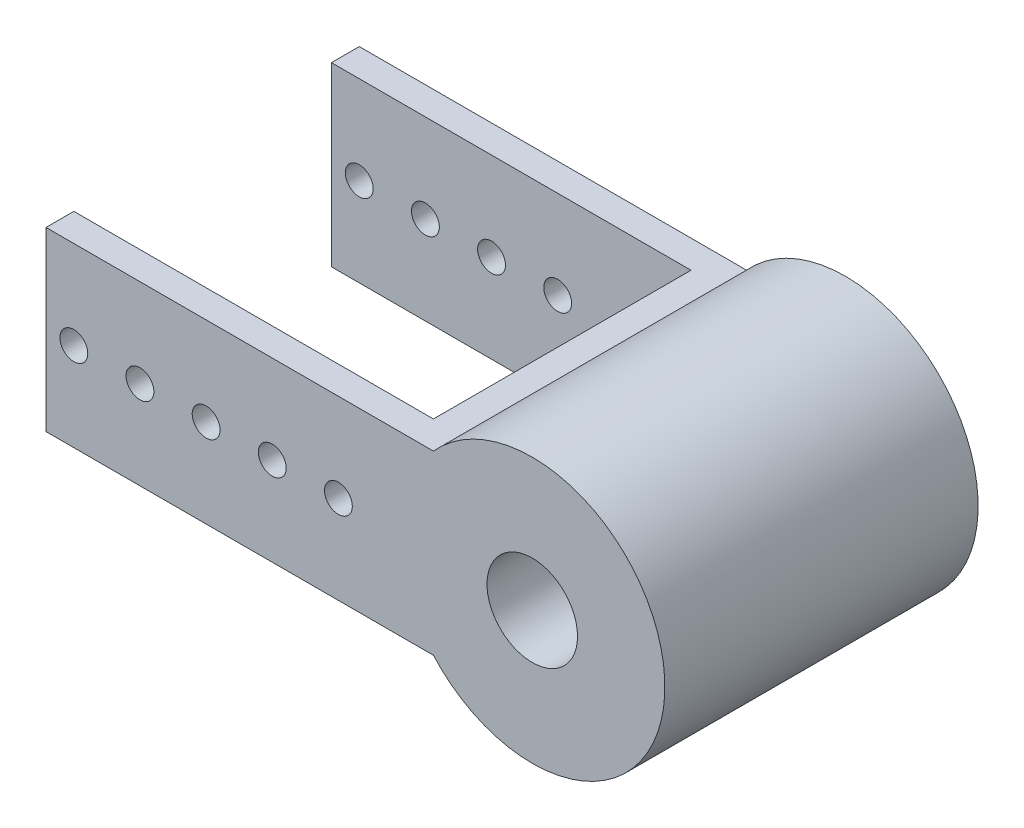
ISO-10303-21;
HEADER;
FILE_DESCRIPTION(('STEP AP214'),'2;1');
FILE_NAME('part.step','',(''),(''),'','','');
FILE_SCHEMA(('AUTOMOTIVE_DESIGN { 1 0 10303 214 1 1 1 1 }'));
ENDSEC;
DATA;
#1=APPLICATION_CONTEXT('core data for automotive mechanical design processes');
#2=APPLICATION_PROTOCOL_DEFINITION('international standard','automotive_design',2000,#1);
#3=PRODUCT_CONTEXT('',#1,'mechanical');
#4=PRODUCT('Part','Part','',(#3));
#5=PRODUCT_RELATED_PRODUCT_CATEGORY('part','',(#4));
#6=PRODUCT_DEFINITION_FORMATION('','',#4);
#7=PRODUCT_DEFINITION_CONTEXT('part definition',#1,'design');
#8=PRODUCT_DEFINITION('design','',#6,#7);
#9=PRODUCT_DEFINITION_SHAPE('','',#8);
#10=(LENGTH_UNIT() NAMED_UNIT(*) SI_UNIT(.MILLI.,.METRE.));
#11=(NAMED_UNIT(*) PLANE_ANGLE_UNIT() SI_UNIT($,.RADIAN.));
#12=(NAMED_UNIT(*) SI_UNIT($,.STERADIAN.) SOLID_ANGLE_UNIT());
#13=UNCERTAINTY_MEASURE_WITH_UNIT(LENGTH_MEASURE(1.E-05),#10,'distance_accuracy_value','');
#14=(GEOMETRIC_REPRESENTATION_CONTEXT(3) GLOBAL_UNCERTAINTY_ASSIGNED_CONTEXT((#13)) GLOBAL_UNIT_ASSIGNED_CONTEXT((#10,
#11,#12)) REPRESENTATION_CONTEXT('',''));
#15=CARTESIAN_POINT('',(0.,0.,0.));
#16=DIRECTION('',(0.,0.,1.));
#17=DIRECTION('',(1.,0.,0.));
#18=AXIS2_PLACEMENT_3D('',#15,#16,#17);
#19=CARTESIAN_POINT('',(-139.7,25.4,45.));
#20=DIRECTION('',(1.,0.,0.));
#21=DIRECTION('',(0.,0.,-1.));
#22=AXIS2_PLACEMENT_3D('',#19,#20,#21);
#23=PLANE('',#22);
#24=DIRECTION('',(0.,0.,-1.));
#25=VECTOR('',#24,1.);
#26=CARTESIAN_POINT('',(-139.7,-25.4,45.));
#27=LINE('',#26,#25);
#28=CARTESIAN_POINT('',(-139.7,-25.4,-37.));
#29=VERTEX_POINT('',#28);
#30=CARTESIAN_POINT('',(-139.7,-25.4,-45.));
#31=VERTEX_POINT('',#30);
#32=EDGE_CURVE('E189',#29,#31,#27,.T.);
#33=ORIENTED_EDGE('',*,*,#32,.F.);
#34=DIRECTION('',(0.,1.,0.));
#35=VECTOR('',#34,1.);
#36=CARTESIAN_POINT('',(-139.7,-38.1,-37.));
#37=LINE('',#36,#35);
#38=CARTESIAN_POINT('',(-139.7,25.4,-37.));
#39=VERTEX_POINT('',#38);
#40=EDGE_CURVE('E200',#29,#39,#37,.T.);
#41=ORIENTED_EDGE('',*,*,#40,.T.);
#42=DIRECTION('',(0.,0.,-1.));
#43=VECTOR('',#42,1.);
#44=CARTESIAN_POINT('',(-139.7,25.4,45.));
#45=LINE('',#44,#43);
#46=CARTESIAN_POINT('',(-139.7,25.4,-45.));
#47=VERTEX_POINT('',#46);
#48=EDGE_CURVE('E193',#39,#47,#45,.T.);
#49=ORIENTED_EDGE('',*,*,#48,.T.);
#50=DIRECTION('',(0.,-1.,0.));
#51=VECTOR('',#50,1.);
#52=CARTESIAN_POINT('',(-139.7,25.4,-45.));
#53=LINE('',#52,#51);
#54=EDGE_CURVE('E184',#47,#31,#53,.T.);
#55=ORIENTED_EDGE('',*,*,#54,.T.);
#56=EDGE_LOOP('',(#33,#41,#49,#55));
#57=FACE_BOUND('',#56,.T.);
#58=ADVANCED_FACE('F37',(#57),#23,.F.);
#59=CARTESIAN_POINT('',(-131.7,0.,45.));
#60=DIRECTION('',(0.,0.,-1.));
#61=DIRECTION('',(-1.,0.,0.));
#62=AXIS2_PLACEMENT_3D('',#59,#60,#61);
#63=CYLINDRICAL_SURFACE('',#62,3.99999999999999);
#64=CARTESIAN_POINT('',(-131.7,0.,-37.));
#65=DIRECTION('',(0.,0.,-1.));
#66=DIRECTION('',(-1.,0.,0.));
#67=AXIS2_PLACEMENT_3D('',#64,#65,#66);
#68=CIRCLE('',#67,3.99999999999999);
#69=CARTESIAN_POINT('',(-135.7,0.,-37.));
#70=VERTEX_POINT('',#69);
#71=EDGE_CURVE('E217',#70,#70,#68,.T.);
#72=ORIENTED_EDGE('',*,*,#71,.F.);
#73=EDGE_LOOP('',(#72));
#74=FACE_BOUND('',#73,.T.);
#75=CARTESIAN_POINT('',(-131.7,0.,-45.));
#76=DIRECTION('',(0.,0.,1.));
#77=DIRECTION('',(1.,0.,0.));
#78=AXIS2_PLACEMENT_3D('',#75,#76,#77);
#79=CIRCLE('',#78,3.99999999999999);
#80=CARTESIAN_POINT('',(-127.7,0.,-45.));
#81=VERTEX_POINT('',#80);
#82=EDGE_CURVE('E157',#81,#81,#79,.T.);
#83=ORIENTED_EDGE('',*,*,#82,.F.);
#84=EDGE_LOOP('',(#83));
#85=FACE_BOUND('',#84,.T.);
#86=ADVANCED_FACE('F260',(#74,#85),#63,.F.);
#87=CARTESIAN_POINT('',(-112.7,0.,45.));
#88=DIRECTION('',(0.,0.,-1.));
#89=DIRECTION('',(-1.,0.,0.));
#90=AXIS2_PLACEMENT_3D('',#87,#88,#89);
#91=CYLINDRICAL_SURFACE('',#90,3.99999999999999);
#92=CARTESIAN_POINT('',(-112.7,0.,-37.));
#93=DIRECTION('',(0.,0.,-1.));
#94=DIRECTION('',(-1.,0.,0.));
#95=AXIS2_PLACEMENT_3D('',#92,#93,#94);
#96=CIRCLE('',#95,3.99999999999999);
#97=CARTESIAN_POINT('',(-116.7,0.,-37.));
#98=VERTEX_POINT('',#97);
#99=EDGE_CURVE('E211',#98,#98,#96,.T.);
#100=ORIENTED_EDGE('',*,*,#99,.F.);
#101=EDGE_LOOP('',(#100));
#102=FACE_BOUND('',#101,.T.);
#103=CARTESIAN_POINT('',(-112.7,0.,-45.));
#104=DIRECTION('',(0.,0.,1.));
#105=DIRECTION('',(1.,0.,0.));
#106=AXIS2_PLACEMENT_3D('',#103,#104,#105);
#107=CIRCLE('',#106,3.99999999999999);
#108=CARTESIAN_POINT('',(-108.7,0.,-45.));
#109=VERTEX_POINT('',#108);
#110=EDGE_CURVE('E151',#109,#109,#107,.T.);
#111=ORIENTED_EDGE('',*,*,#110,.F.);
#112=EDGE_LOOP('',(#111));
#113=FACE_BOUND('',#112,.T.);
#114=ADVANCED_FACE('F297',(#102,#113),#91,.F.);
#115=CARTESIAN_POINT('',(-93.7,0.,45.));
#116=DIRECTION('',(0.,0.,-1.));
#117=DIRECTION('',(-1.,0.,0.));
#118=AXIS2_PLACEMENT_3D('',#115,#116,#117);
#119=CYLINDRICAL_SURFACE('',#118,3.99999999999999);
#120=CARTESIAN_POINT('',(-93.7,0.,-37.));
#121=DIRECTION('',(0.,0.,-1.));
#122=DIRECTION('',(-1.,0.,0.));
#123=AXIS2_PLACEMENT_3D('',#120,#121,#122);
#124=CIRCLE('',#123,3.99999999999999);
#125=CARTESIAN_POINT('',(-97.7,0.,-37.));
#126=VERTEX_POINT('',#125);
#127=EDGE_CURVE('E206',#126,#126,#124,.T.);
#128=ORIENTED_EDGE('',*,*,#127,.F.);
#129=EDGE_LOOP('',(#128));
#130=FACE_BOUND('',#129,.T.);
#131=CARTESIAN_POINT('',(-93.7,0.,-45.));
#132=DIRECTION('',(0.,0.,1.));
#133=DIRECTION('',(1.,0.,0.));
#134=AXIS2_PLACEMENT_3D('',#131,#132,#133);
#135=CIRCLE('',#134,3.99999999999999);
#136=CARTESIAN_POINT('',(-89.7,0.,-45.));
#137=VERTEX_POINT('',#136);
#138=EDGE_CURVE('E145',#137,#137,#135,.T.);
#139=ORIENTED_EDGE('',*,*,#138,.F.);
#140=EDGE_LOOP('',(#139));
#141=FACE_BOUND('',#140,.T.);
#142=ADVANCED_FACE('F323',(#130,#141),#119,.F.);
#143=CARTESIAN_POINT('',(-74.7,0.,45.));
#144=DIRECTION('',(0.,0.,-1.));
#145=DIRECTION('',(-1.,0.,0.));
#146=AXIS2_PLACEMENT_3D('',#143,#144,#145);
#147=CYLINDRICAL_SURFACE('',#146,3.99999999999999);
#148=CARTESIAN_POINT('',(-74.7,0.,-37.));
#149=DIRECTION('',(0.,0.,-1.));
#150=DIRECTION('',(-1.,0.,0.));
#151=AXIS2_PLACEMENT_3D('',#148,#149,#150);
#152=CIRCLE('',#151,3.99999999999999);
#153=CARTESIAN_POINT('',(-78.7,0.,-37.));
#154=VERTEX_POINT('',#153);
#155=EDGE_CURVE('E202',#154,#154,#152,.T.);
#156=ORIENTED_EDGE('',*,*,#155,.F.);
#157=EDGE_LOOP('',(#156));
#158=FACE_BOUND('',#157,.T.);
#159=CARTESIAN_POINT('',(-74.7,0.,-45.));
#160=DIRECTION('',(0.,0.,1.));
#161=DIRECTION('',(1.,0.,0.));
#162=AXIS2_PLACEMENT_3D('',#159,#160,#161);
#163=CIRCLE('',#162,3.99999999999999);
#164=CARTESIAN_POINT('',(-70.7,0.,-45.));
#165=VERTEX_POINT('',#164);
#166=EDGE_CURVE('E140',#165,#165,#163,.T.);
#167=ORIENTED_EDGE('',*,*,#166,.F.);
#168=EDGE_LOOP('',(#167));
#169=FACE_BOUND('',#168,.T.);
#170=ADVANCED_FACE('F287',(#158,#169),#147,.F.);
#171=CARTESIAN_POINT('',(-55.7,0.,45.));
#172=DIRECTION('',(0.,0.,-1.));
#173=DIRECTION('',(-1.,0.,0.));
#174=AXIS2_PLACEMENT_3D('',#171,#172,#173);
#175=CYLINDRICAL_SURFACE('',#174,3.99999999999999);
#176=CARTESIAN_POINT('',(-55.7,0.,-37.));
#177=DIRECTION('',(0.,0.,-1.));
#178=DIRECTION('',(-1.,0.,0.));
#179=AXIS2_PLACEMENT_3D('',#176,#177,#178);
#180=CIRCLE('',#179,3.99999999999999);
#181=CARTESIAN_POINT('',(-59.7,0.,-37.));
#182=VERTEX_POINT('',#181);
#183=EDGE_CURVE('E115',#182,#182,#180,.T.);
#184=ORIENTED_EDGE('',*,*,#183,.F.);
#185=EDGE_LOOP('',(#184));
#186=FACE_BOUND('',#185,.T.);
#187=CARTESIAN_POINT('',(-55.7,0.,-45.));
#188=DIRECTION('',(0.,0.,1.));
#189=DIRECTION('',(1.,0.,0.));
#190=AXIS2_PLACEMENT_3D('',#187,#188,#189);
#191=CIRCLE('',#190,3.99999999999999);
#192=CARTESIAN_POINT('',(-51.7,0.,-45.));
#193=VERTEX_POINT('',#192);
#194=EDGE_CURVE('E130',#193,#193,#191,.T.);
#195=ORIENTED_EDGE('',*,*,#194,.F.);
#196=EDGE_LOOP('',(#195));
#197=FACE_BOUND('',#196,.T.);
#198=ADVANCED_FACE('F266',(#186,#197),#175,.F.);
#199=CARTESIAN_POINT('',(0.,0.,45.));
#200=DIRECTION('',(0.,0.,1.));
#201=DIRECTION('',(1.,0.,0.));
#202=AXIS2_PLACEMENT_3D('',#199,#200,#201);
#203=PLANE('',#202);
#204=CARTESIAN_POINT('',(-74.7,0.,45.));
#205=DIRECTION('',(0.,0.,1.));
#206=DIRECTION('',(1.,0.,0.));
#207=AXIS2_PLACEMENT_3D('',#204,#205,#206);
#208=CIRCLE('',#207,3.99999999999999);
#209=CARTESIAN_POINT('',(-70.7,0.,45.));
#210=VERTEX_POINT('',#209);
#211=EDGE_CURVE('E142',#210,#210,#208,.T.);
#212=ORIENTED_EDGE('',*,*,#211,.F.);
#213=EDGE_LOOP('',(#212));
#214=FACE_BOUND('',#213,.T.);
#215=CARTESIAN_POINT('',(-112.7,0.,45.));
#216=DIRECTION('',(0.,0.,1.));
#217=DIRECTION('',(1.,0.,0.));
#218=AXIS2_PLACEMENT_3D('',#215,#216,#217);
#219=CIRCLE('',#218,3.99999999999999);
#220=CARTESIAN_POINT('',(-108.7,0.,45.));
#221=VERTEX_POINT('',#220);
#222=EDGE_CURVE('E154',#221,#221,#219,.T.);
#223=ORIENTED_EDGE('',*,*,#222,.F.);
#224=EDGE_LOOP('',(#223));
#225=FACE_BOUND('',#224,.T.);
#226=CARTESIAN_POINT('',(0.,0.,45.));
#227=DIRECTION('',(0.,0.,1.));
#228=DIRECTION('',(1.,0.,0.));
#229=AXIS2_PLACEMENT_3D('',#226,#227,#228);
#230=CIRCLE('',#229,13.);
#231=CARTESIAN_POINT('',(13.,0.,45.));
#232=VERTEX_POINT('',#231);
#233=EDGE_CURVE('E166',#232,#232,#230,.T.);
#234=ORIENTED_EDGE('',*,*,#233,.F.);
#235=EDGE_LOOP('',(#234));
#236=FACE_BOUND('',#235,.T.);
#237=CARTESIAN_POINT('',(0.,0.,45.));
#238=DIRECTION('',(0.,0.,1.));
#239=DIRECTION('',(1.,0.,0.));
#240=AXIS2_PLACEMENT_3D('',#237,#238,#239);
#241=CIRCLE('',#240,38.1);
#242=CARTESIAN_POINT('',(-28.3980633142473,-25.4,45.));
#243=VERTEX_POINT('',#242);
#244=CARTESIAN_POINT('',(-28.3980633142473,25.4,45.));
#245=VERTEX_POINT('',#244);
#246=EDGE_CURVE('E172',#243,#245,#241,.T.);
#247=ORIENTED_EDGE('',*,*,#246,.T.);
#248=DIRECTION('',(-1.,0.,0.));
#249=VECTOR('',#248,1.);
#250=CARTESIAN_POINT('',(-28.3980633142473,25.4,45.));
#251=LINE('',#250,#249);
#252=CARTESIAN_POINT('',(-139.7,25.4,45.));
#253=VERTEX_POINT('',#252);
#254=EDGE_CURVE('E89',#245,#253,#251,.T.);
#255=ORIENTED_EDGE('',*,*,#254,.T.);
#256=DIRECTION('',(0.,-1.,0.));
#257=VECTOR('',#256,1.);
#258=CARTESIAN_POINT('',(-139.7,25.4,45.));
#259=LINE('',#258,#257);
#260=CARTESIAN_POINT('',(-139.7,-25.4,45.));
#261=VERTEX_POINT('',#260);
#262=EDGE_CURVE('E175',#253,#261,#259,.T.);
#263=ORIENTED_EDGE('',*,*,#262,.T.);
#264=DIRECTION('',(1.,0.,0.));
#265=VECTOR('',#264,1.);
#266=CARTESIAN_POINT('',(-28.3980633142473,-25.4,45.));
#267=LINE('',#266,#265);
#268=EDGE_CURVE('E61',#261,#243,#267,.T.);
#269=ORIENTED_EDGE('',*,*,#268,.T.);
#270=EDGE_LOOP('',(#247,#255,#263,#269));
#271=FACE_BOUND('',#270,.T.);
#272=CARTESIAN_POINT('',(-131.7,0.,45.));
#273=DIRECTION('',(0.,0.,1.));
#274=DIRECTION('',(1.,0.,0.));
#275=AXIS2_PLACEMENT_3D('',#272,#273,#274);
#276=CIRCLE('',#275,3.99999999999999);
#277=CARTESIAN_POINT('',(-127.7,0.,45.));
#278=VERTEX_POINT('',#277);
#279=EDGE_CURVE('E160',#278,#278,#276,.T.);
#280=ORIENTED_EDGE('',*,*,#279,.F.);
#281=EDGE_LOOP('',(#280));
#282=FACE_BOUND('',#281,.T.);
#283=CARTESIAN_POINT('',(-93.7,0.,45.));
#284=DIRECTION('',(0.,0.,1.));
#285=DIRECTION('',(1.,0.,0.));
#286=AXIS2_PLACEMENT_3D('',#283,#284,#285);
#287=CIRCLE('',#286,3.99999999999999);
#288=CARTESIAN_POINT('',(-89.7,0.,45.));
#289=VERTEX_POINT('',#288);
#290=EDGE_CURVE('E148',#289,#289,#287,.T.);
#291=ORIENTED_EDGE('',*,*,#290,.F.);
#292=EDGE_LOOP('',(#291));
#293=FACE_BOUND('',#292,.T.);
#294=CARTESIAN_POINT('',(-55.7,0.,45.));
#295=DIRECTION('',(0.,0.,1.));
#296=DIRECTION('',(1.,0.,0.));
#297=AXIS2_PLACEMENT_3D('',#294,#295,#296);
#298=CIRCLE('',#297,3.99999999999999);
#299=CARTESIAN_POINT('',(-51.7,0.,45.));
#300=VERTEX_POINT('',#299);
#301=EDGE_CURVE('E133',#300,#300,#298,.T.);
#302=ORIENTED_EDGE('',*,*,#301,.F.);
#303=EDGE_LOOP('',(#302));
#304=FACE_BOUND('',#303,.T.);
#305=ADVANCED_FACE('F263',(#214,#225,#236,#271,#282,#293,#304),#203,.T.);
#306=CARTESIAN_POINT('',(0.,0.,-45.));
#307=DIRECTION('',(0.,0.,1.));
#308=DIRECTION('',(1.,0.,0.));
#309=AXIS2_PLACEMENT_3D('',#306,#307,#308);
#310=PLANE('',#309);
#311=CARTESIAN_POINT('',(0.,0.,-45.));
#312=DIRECTION('',(0.,0.,1.));
#313=DIRECTION('',(1.,0.,0.));
#314=AXIS2_PLACEMENT_3D('',#311,#312,#313);
#315=CIRCLE('',#314,38.1);
#316=CARTESIAN_POINT('',(-28.3980633142473,-25.4,-45.));
#317=VERTEX_POINT('',#316);
#318=CARTESIAN_POINT('',(-28.3980633142473,25.4,-45.));
#319=VERTEX_POINT('',#318);
#320=EDGE_CURVE('E169',#317,#319,#315,.T.);
#321=ORIENTED_EDGE('',*,*,#320,.F.);
#322=DIRECTION('',(1.,0.,0.));
#323=VECTOR('',#322,1.);
#324=CARTESIAN_POINT('',(-28.3980633142473,-25.4,-45.));
#325=LINE('',#324,#323);
#326=EDGE_CURVE('E81',#31,#317,#325,.T.);
#327=ORIENTED_EDGE('',*,*,#326,.F.);
#328=ORIENTED_EDGE('',*,*,#54,.F.);
#329=DIRECTION('',(-1.,0.,0.));
#330=VECTOR('',#329,1.);
#331=CARTESIAN_POINT('',(-28.3980633142473,25.4,-45.));
#332=LINE('',#331,#330);
#333=EDGE_CURVE('E181',#319,#47,#332,.T.);
#334=ORIENTED_EDGE('',*,*,#333,.F.);
#335=EDGE_LOOP('',(#321,#327,#328,#334));
#336=FACE_BOUND('',#335,.T.);
#337=CARTESIAN_POINT('',(0.,0.,-45.));
#338=DIRECTION('',(0.,0.,1.));
#339=DIRECTION('',(1.,0.,0.));
#340=AXIS2_PLACEMENT_3D('',#337,#338,#339);
#341=CIRCLE('',#340,13.);
#342=CARTESIAN_POINT('',(13.,0.,-45.));
#343=VERTEX_POINT('',#342);
#344=EDGE_CURVE('E163',#343,#343,#341,.T.);
#345=ORIENTED_EDGE('',*,*,#344,.T.);
#346=EDGE_LOOP('',(#345));
#347=FACE_BOUND('',#346,.T.);
#348=ORIENTED_EDGE('',*,*,#82,.T.);
#349=EDGE_LOOP('',(#348));
#350=FACE_BOUND('',#349,.T.);
#351=ORIENTED_EDGE('',*,*,#110,.T.);
#352=EDGE_LOOP('',(#351));
#353=FACE_BOUND('',#352,.T.);
#354=ORIENTED_EDGE('',*,*,#138,.T.);
#355=EDGE_LOOP('',(#354));
#356=FACE_BOUND('',#355,.T.);
#357=ORIENTED_EDGE('',*,*,#166,.T.);
#358=EDGE_LOOP('',(#357));
#359=FACE_BOUND('',#358,.T.);
#360=ORIENTED_EDGE('',*,*,#194,.T.);
#361=EDGE_LOOP('',(#360));
#362=FACE_BOUND('',#361,.T.);
#363=ADVANCED_FACE('F228',(#336,#347,#350,#353,#356,#359,#362),#310,.F.);
#364=CARTESIAN_POINT('',(0.,0.,45.));
#365=DIRECTION('',(0.,0.,-1.));
#366=DIRECTION('',(-1.,0.,0.));
#367=AXIS2_PLACEMENT_3D('',#364,#365,#366);
#368=CYLINDRICAL_SURFACE('',#367,38.1);
#369=ORIENTED_EDGE('',*,*,#320,.T.);
#370=DIRECTION('',(0.,0.,-1.));
#371=VECTOR('',#370,1.);
#372=CARTESIAN_POINT('',(-28.3980633142473,25.4,45.));
#373=LINE('',#372,#371);
#374=EDGE_CURVE('E45',#245,#319,#373,.T.);
#375=ORIENTED_EDGE('',*,*,#374,.F.);
#376=ORIENTED_EDGE('',*,*,#246,.F.);
#377=DIRECTION('',(0.,0.,-1.));
#378=VECTOR('',#377,1.);
#379=CARTESIAN_POINT('',(-28.3980633142473,-25.4,45.));
#380=LINE('',#379,#378);
#381=EDGE_CURVE('E178',#243,#317,#380,.T.);
#382=ORIENTED_EDGE('',*,*,#381,.T.);
#383=EDGE_LOOP('',(#369,#375,#376,#382));
#384=FACE_BOUND('',#383,.T.);
#385=ADVANCED_FACE('F39',(#384),#368,.T.);
#386=CARTESIAN_POINT('',(-28.3980633142473,25.4,45.));
#387=DIRECTION('',(0.,-1.,0.));
#388=DIRECTION('',(1.,0.,0.));
#389=AXIS2_PLACEMENT_3D('',#386,#387,#388);
#390=PLANE('',#389);
#391=ORIENTED_EDGE('',*,*,#48,.F.);
#392=DIRECTION('',(1.,0.,0.));
#393=VECTOR('',#392,1.);
#394=CARTESIAN_POINT('',(-28.3980633142473,25.4,-37.));
#395=LINE('',#394,#393);
#396=CARTESIAN_POINT('',(-36.3980633142473,25.4,-37.));
#397=VERTEX_POINT('',#396);
#398=EDGE_CURVE('E129',#39,#397,#395,.T.);
#399=ORIENTED_EDGE('',*,*,#398,.T.);
#400=DIRECTION('',(0.,0.,1.));
#401=VECTOR('',#400,1.);
#402=CARTESIAN_POINT('',(-36.3980633142473,25.4,45.));
#403=LINE('',#402,#401);
#404=CARTESIAN_POINT('',(-36.3980633142473,25.4,37.));
#405=VERTEX_POINT('',#404);
#406=EDGE_CURVE('E121',#397,#405,#403,.T.);
#407=ORIENTED_EDGE('',*,*,#406,.T.);
#408=DIRECTION('',(-1.,0.,0.));
#409=VECTOR('',#408,1.);
#410=CARTESIAN_POINT('',(-28.3980633142473,25.4,37.));
#411=LINE('',#410,#409);
#412=CARTESIAN_POINT('',(-139.7,25.4,37.));
#413=VERTEX_POINT('',#412);
#414=EDGE_CURVE('E109',#405,#413,#411,.T.);
#415=ORIENTED_EDGE('',*,*,#414,.T.);
#416=EDGE_CURVE('E194',#253,#413,#45,.T.);
#417=ORIENTED_EDGE('',*,*,#416,.F.);
#418=ORIENTED_EDGE('',*,*,#254,.F.);
#419=ORIENTED_EDGE('',*,*,#374,.T.);
#420=ORIENTED_EDGE('',*,*,#333,.T.);
#421=EDGE_LOOP('',(#391,#399,#407,#415,#417,#418,#419,#420));
#422=FACE_BOUND('',#421,.T.);
#423=ADVANCED_FACE('F128',(#422),#390,.F.);
#424=ORIENTED_EDGE('',*,*,#416,.T.);
#425=DIRECTION('',(0.,1.,0.));
#426=VECTOR('',#425,1.);
#427=CARTESIAN_POINT('',(-139.7,-38.1,37.));
#428=LINE('',#427,#426);
#429=CARTESIAN_POINT('',(-139.7,-25.4,37.));
#430=VERTEX_POINT('',#429);
#431=EDGE_CURVE('E112',#430,#413,#428,.T.);
#432=ORIENTED_EDGE('',*,*,#431,.F.);
#433=EDGE_CURVE('E190',#261,#430,#27,.T.);
#434=ORIENTED_EDGE('',*,*,#433,.F.);
#435=ORIENTED_EDGE('',*,*,#262,.F.);
#436=EDGE_LOOP('',(#424,#432,#434,#435));
#437=FACE_BOUND('',#436,.T.);
#438=ADVANCED_FACE('F236',(#437),#23,.F.);
#439=CARTESIAN_POINT('',(-28.3980633142473,-25.4,45.));
#440=DIRECTION('',(0.,1.,0.));
#441=DIRECTION('',(-1.,0.,0.));
#442=AXIS2_PLACEMENT_3D('',#439,#440,#441);
#443=PLANE('',#442);
#444=DIRECTION('',(0.,0.,-1.));
#445=VECTOR('',#444,1.);
#446=CARTESIAN_POINT('',(-36.3980633142473,-25.4,45.));
#447=LINE('',#446,#445);
#448=CARTESIAN_POINT('',(-36.3980633142473,-25.4,37.));
#449=VERTEX_POINT('',#448);
#450=CARTESIAN_POINT('',(-36.3980633142473,-25.4,-37.));
#451=VERTEX_POINT('',#450);
#452=EDGE_CURVE('E11',#449,#451,#447,.T.);
#453=ORIENTED_EDGE('',*,*,#452,.T.);
#454=DIRECTION('',(-1.,0.,0.));
#455=VECTOR('',#454,1.);
#456=CARTESIAN_POINT('',(-28.3980633142473,-25.4,-37.));
#457=LINE('',#456,#455);
#458=EDGE_CURVE('E135',#451,#29,#457,.T.);
#459=ORIENTED_EDGE('',*,*,#458,.T.);
#460=ORIENTED_EDGE('',*,*,#32,.T.);
#461=ORIENTED_EDGE('',*,*,#326,.T.);
#462=ORIENTED_EDGE('',*,*,#381,.F.);
#463=ORIENTED_EDGE('',*,*,#268,.F.);
#464=ORIENTED_EDGE('',*,*,#433,.T.);
#465=DIRECTION('',(1.,0.,0.));
#466=VECTOR('',#465,1.);
#467=CARTESIAN_POINT('',(-28.3980633142473,-25.4,37.));
#468=LINE('',#467,#466);
#469=EDGE_CURVE('E116',#430,#449,#468,.T.);
#470=ORIENTED_EDGE('',*,*,#469,.T.);
#471=EDGE_LOOP('',(#453,#459,#460,#461,#462,#463,#464,#470));
#472=FACE_BOUND('',#471,.T.);
#473=ADVANCED_FACE('F221',(#472),#443,.F.);
#474=CARTESIAN_POINT('',(0.,0.,45.));
#475=DIRECTION('',(0.,0.,-1.));
#476=DIRECTION('',(-1.,0.,0.));
#477=AXIS2_PLACEMENT_3D('',#474,#475,#476);
#478=CYLINDRICAL_SURFACE('',#477,13.);
#479=ORIENTED_EDGE('',*,*,#233,.T.);
#480=EDGE_LOOP('',(#479));
#481=FACE_BOUND('',#480,.T.);
#482=ORIENTED_EDGE('',*,*,#344,.F.);
#483=EDGE_LOOP('',(#482));
#484=FACE_BOUND('',#483,.T.);
#485=ADVANCED_FACE('F258',(#481,#484),#478,.F.);
#486=CARTESIAN_POINT('',(-131.7,0.,37.));
#487=DIRECTION('',(0.,0.,1.));
#488=DIRECTION('',(1.,0.,0.));
#489=AXIS2_PLACEMENT_3D('',#486,#487,#488);
#490=CIRCLE('',#489,3.99999999999999);
#491=CARTESIAN_POINT('',(-127.7,0.,37.));
#492=VERTEX_POINT('',#491);
#493=EDGE_CURVE('E248',#492,#492,#490,.T.);
#494=ORIENTED_EDGE('',*,*,#493,.F.);
#495=EDGE_LOOP('',(#494));
#496=FACE_BOUND('',#495,.T.);
#497=ORIENTED_EDGE('',*,*,#279,.T.);
#498=EDGE_LOOP('',(#497));
#499=FACE_BOUND('',#498,.T.);
#500=ADVANCED_FACE('F254',(#496,#499),#63,.F.);
#501=CARTESIAN_POINT('',(-112.7,0.,37.));
#502=DIRECTION('',(0.,0.,1.));
#503=DIRECTION('',(1.,0.,0.));
#504=AXIS2_PLACEMENT_3D('',#501,#502,#503);
#505=CIRCLE('',#504,3.99999999999999);
#506=CARTESIAN_POINT('',(-108.7,0.,37.));
#507=VERTEX_POINT('',#506);
#508=EDGE_CURVE('E245',#507,#507,#505,.T.);
#509=ORIENTED_EDGE('',*,*,#508,.F.);
#510=EDGE_LOOP('',(#509));
#511=FACE_BOUND('',#510,.T.);
#512=ORIENTED_EDGE('',*,*,#222,.T.);
#513=EDGE_LOOP('',(#512));
#514=FACE_BOUND('',#513,.T.);
#515=ADVANCED_FACE('F257',(#511,#514),#91,.F.);
#516=CARTESIAN_POINT('',(-93.7,0.,37.));
#517=DIRECTION('',(0.,0.,1.));
#518=DIRECTION('',(1.,0.,0.));
#519=AXIS2_PLACEMENT_3D('',#516,#517,#518);
#520=CIRCLE('',#519,3.99999999999999);
#521=CARTESIAN_POINT('',(-89.7,0.,37.));
#522=VERTEX_POINT('',#521);
#523=EDGE_CURVE('E242',#522,#522,#520,.T.);
#524=ORIENTED_EDGE('',*,*,#523,.F.);
#525=EDGE_LOOP('',(#524));
#526=FACE_BOUND('',#525,.T.);
#527=ORIENTED_EDGE('',*,*,#290,.T.);
#528=EDGE_LOOP('',(#527));
#529=FACE_BOUND('',#528,.T.);
#530=ADVANCED_FACE('F284',(#526,#529),#119,.F.);
#531=CARTESIAN_POINT('',(-74.7,0.,37.));
#532=DIRECTION('',(0.,0.,1.));
#533=DIRECTION('',(1.,0.,0.));
#534=AXIS2_PLACEMENT_3D('',#531,#532,#533);
#535=CIRCLE('',#534,3.99999999999999);
#536=CARTESIAN_POINT('',(-70.7,0.,37.));
#537=VERTEX_POINT('',#536);
#538=EDGE_CURVE('E199',#537,#537,#535,.T.);
#539=ORIENTED_EDGE('',*,*,#538,.F.);
#540=EDGE_LOOP('',(#539));
#541=FACE_BOUND('',#540,.T.);
#542=ORIENTED_EDGE('',*,*,#211,.T.);
#543=EDGE_LOOP('',(#542));
#544=FACE_BOUND('',#543,.T.);
#545=ADVANCED_FACE('F275',(#541,#544),#147,.F.);
#546=CARTESIAN_POINT('',(-55.7,0.,37.));
#547=DIRECTION('',(0.,0.,1.));
#548=DIRECTION('',(1.,0.,0.));
#549=AXIS2_PLACEMENT_3D('',#546,#547,#548);
#550=CIRCLE('',#549,3.99999999999999);
#551=CARTESIAN_POINT('',(-51.7,0.,37.));
#552=VERTEX_POINT('',#551);
#553=EDGE_CURVE('E197',#552,#552,#550,.T.);
#554=ORIENTED_EDGE('',*,*,#553,.F.);
#555=EDGE_LOOP('',(#554));
#556=FACE_BOUND('',#555,.T.);
#557=ORIENTED_EDGE('',*,*,#301,.T.);
#558=EDGE_LOOP('',(#557));
#559=FACE_BOUND('',#558,.T.);
#560=ADVANCED_FACE('F273',(#556,#559),#175,.F.);
#561=CARTESIAN_POINT('',(-36.3980633142473,-38.1,-37.));
#562=DIRECTION('',(1.,0.,0.));
#563=DIRECTION('',(0.,0.,-1.));
#564=AXIS2_PLACEMENT_3D('',#561,#562,#563);
#565=PLANE('',#564);
#566=DIRECTION('',(0.,1.,0.));
#567=VECTOR('',#566,1.);
#568=CARTESIAN_POINT('',(-36.3980633142473,-38.1,-37.));
#569=LINE('',#568,#567);
#570=EDGE_CURVE('E124',#451,#397,#569,.T.);
#571=ORIENTED_EDGE('',*,*,#570,.F.);
#572=ORIENTED_EDGE('',*,*,#452,.F.);
#573=DIRECTION('',(0.,1.,0.));
#574=VECTOR('',#573,1.);
#575=CARTESIAN_POINT('',(-36.3980633142473,-38.1,37.));
#576=LINE('',#575,#574);
#577=EDGE_CURVE('E52',#449,#405,#576,.T.);
#578=ORIENTED_EDGE('',*,*,#577,.T.);
#579=ORIENTED_EDGE('',*,*,#406,.F.);
#580=EDGE_LOOP('',(#571,#572,#578,#579));
#581=FACE_BOUND('',#580,.T.);
#582=ADVANCED_FACE('F120',(#581),#565,.F.);
#583=CARTESIAN_POINT('',(-139.7,-38.1,-37.));
#584=DIRECTION('',(0.,0.,-1.));
#585=DIRECTION('',(-1.,0.,0.));
#586=AXIS2_PLACEMENT_3D('',#583,#584,#585);
#587=PLANE('',#586);
#588=ORIENTED_EDGE('',*,*,#71,.T.);
#589=EDGE_LOOP('',(#588));
#590=FACE_BOUND('',#589,.T.);
#591=ORIENTED_EDGE('',*,*,#99,.T.);
#592=EDGE_LOOP('',(#591));
#593=FACE_BOUND('',#592,.T.);
#594=ORIENTED_EDGE('',*,*,#127,.T.);
#595=EDGE_LOOP('',(#594));
#596=FACE_BOUND('',#595,.T.);
#597=ORIENTED_EDGE('',*,*,#155,.T.);
#598=EDGE_LOOP('',(#597));
#599=FACE_BOUND('',#598,.T.);
#600=ORIENTED_EDGE('',*,*,#183,.T.);
#601=EDGE_LOOP('',(#600));
#602=FACE_BOUND('',#601,.T.);
#603=ORIENTED_EDGE('',*,*,#40,.F.);
#604=ORIENTED_EDGE('',*,*,#458,.F.);
#605=ORIENTED_EDGE('',*,*,#570,.T.);
#606=ORIENTED_EDGE('',*,*,#398,.F.);
#607=EDGE_LOOP('',(#603,#604,#605,#606));
#608=FACE_BOUND('',#607,.T.);
#609=ADVANCED_FACE('F282',(#590,#593,#596,#599,#602,#608),#587,.F.);
#610=CARTESIAN_POINT('',(-36.3980633142473,-38.1,37.));
#611=DIRECTION('',(0.,0.,1.));
#612=DIRECTION('',(1.,0.,0.));
#613=AXIS2_PLACEMENT_3D('',#610,#611,#612);
#614=PLANE('',#613);
#615=ORIENTED_EDGE('',*,*,#493,.T.);
#616=EDGE_LOOP('',(#615));
#617=FACE_BOUND('',#616,.T.);
#618=ORIENTED_EDGE('',*,*,#508,.T.);
#619=EDGE_LOOP('',(#618));
#620=FACE_BOUND('',#619,.T.);
#621=ORIENTED_EDGE('',*,*,#523,.T.);
#622=EDGE_LOOP('',(#621));
#623=FACE_BOUND('',#622,.T.);
#624=ORIENTED_EDGE('',*,*,#538,.T.);
#625=EDGE_LOOP('',(#624));
#626=FACE_BOUND('',#625,.T.);
#627=ORIENTED_EDGE('',*,*,#553,.T.);
#628=EDGE_LOOP('',(#627));
#629=FACE_BOUND('',#628,.T.);
#630=ORIENTED_EDGE('',*,*,#577,.F.);
#631=ORIENTED_EDGE('',*,*,#469,.F.);
#632=ORIENTED_EDGE('',*,*,#431,.T.);
#633=ORIENTED_EDGE('',*,*,#414,.F.);
#634=EDGE_LOOP('',(#630,#631,#632,#633));
#635=FACE_BOUND('',#634,.T.);
#636=ADVANCED_FACE('F110',(#617,#620,#623,#626,#629,#635),#614,.F.);
#637=CLOSED_SHELL('',(#58,#86,#114,#142,#170,#198,#305,#363,#385,#423,#438,#473,#485,#500,#515,
#530,#545,#560,#582,#609,#636));
#638=MANIFOLD_SOLID_BREP('B2',#637);
#639=ADVANCED_BREP_SHAPE_REPRESENTATION('',(#18,#638),#14);
#640=SHAPE_DEFINITION_REPRESENTATION(#9,#639);
ENDSEC;
END-ISO-10303-21;
